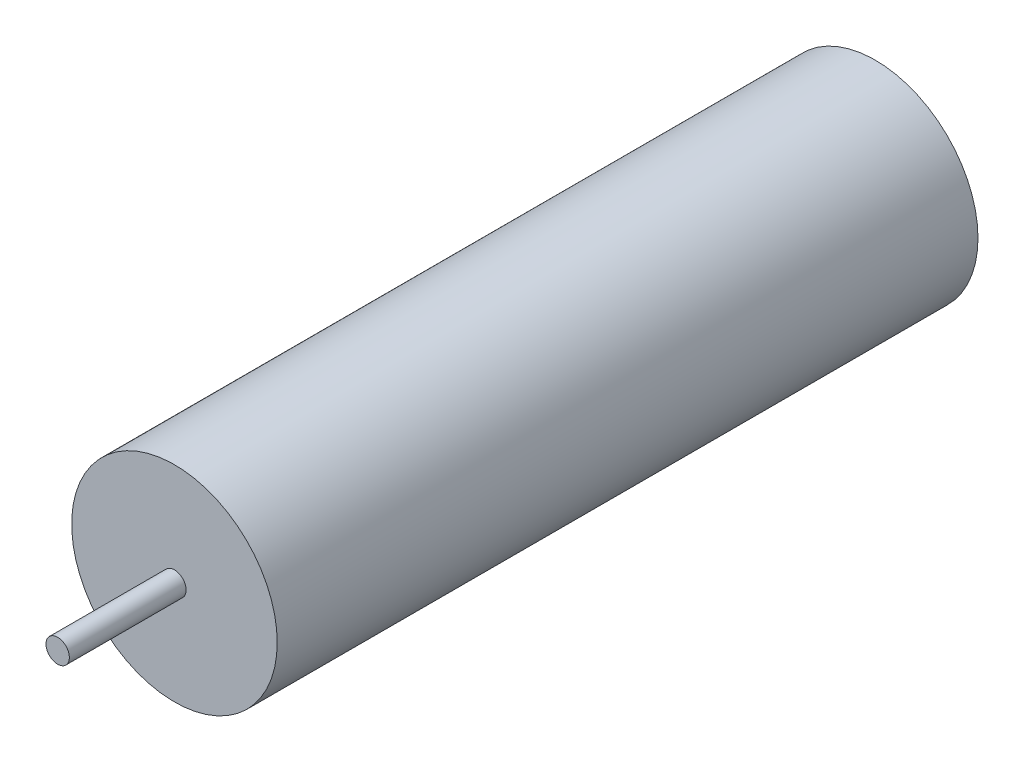
ISO-10303-21;
HEADER;
FILE_DESCRIPTION(('STEP AP214'),'2;1');
FILE_NAME('part.step','',(''),(''),'','','');
FILE_SCHEMA(('AUTOMOTIVE_DESIGN { 1 0 10303 214 1 1 1 1 }'));
ENDSEC;
DATA;
#1=APPLICATION_CONTEXT('core data for automotive mechanical design processes');
#2=APPLICATION_PROTOCOL_DEFINITION('international standard','automotive_design',2000,#1);
#3=PRODUCT_CONTEXT('',#1,'mechanical');
#4=PRODUCT('Part','Part','',(#3));
#5=PRODUCT_RELATED_PRODUCT_CATEGORY('part','',(#4));
#6=PRODUCT_DEFINITION_FORMATION('','',#4);
#7=PRODUCT_DEFINITION_CONTEXT('part definition',#1,'design');
#8=PRODUCT_DEFINITION('design','',#6,#7);
#9=PRODUCT_DEFINITION_SHAPE('','',#8);
#10=(LENGTH_UNIT() NAMED_UNIT(*) SI_UNIT(.MILLI.,.METRE.));
#11=(NAMED_UNIT(*) PLANE_ANGLE_UNIT() SI_UNIT($,.RADIAN.));
#12=(NAMED_UNIT(*) SI_UNIT($,.STERADIAN.) SOLID_ANGLE_UNIT());
#13=UNCERTAINTY_MEASURE_WITH_UNIT(LENGTH_MEASURE(1.E-05),#10,'distance_accuracy_value','');
#14=(GEOMETRIC_REPRESENTATION_CONTEXT(3) GLOBAL_UNCERTAINTY_ASSIGNED_CONTEXT((#13)) GLOBAL_UNIT_ASSIGNED_CONTEXT((#10,
#11,#12)) REPRESENTATION_CONTEXT('',''));
#15=CARTESIAN_POINT('',(0.,0.,0.));
#16=DIRECTION('',(0.,0.,1.));
#17=DIRECTION('',(1.,0.,0.));
#18=AXIS2_PLACEMENT_3D('',#15,#16,#17);
#19=CARTESIAN_POINT('',(4.5102810375397E-13,-25.4000000000004,-76.2));
#20=DIRECTION('',(0.,0.,1.));
#21=DIRECTION('',(1.,0.,0.));
#22=AXIS2_PLACEMENT_3D('',#19,#20,#21);
#23=CYLINDRICAL_SURFACE('',#22,11.176);
#24=CARTESIAN_POINT('',(4.5102810375397E-13,-25.4000000000004,-76.2));
#25=DIRECTION('',(0.,0.,1.));
#26=DIRECTION('',(1.,0.,0.));
#27=AXIS2_PLACEMENT_3D('',#24,#25,#26);
#28=CIRCLE('',#27,11.176);
#29=CARTESIAN_POINT('',(11.1760000000004,-25.4000000000004,-76.2));
#30=VERTEX_POINT('',#29);
#31=EDGE_CURVE('E10',#30,#30,#28,.T.);
#32=ORIENTED_EDGE('',*,*,#31,.T.);
#33=EDGE_LOOP('',(#32));
#34=FACE_BOUND('',#33,.T.);
#35=CARTESIAN_POINT('',(4.5102810375397E-13,-25.4000000000004,0.));
#36=DIRECTION('',(0.,0.,1.));
#37=DIRECTION('',(1.,0.,0.));
#38=AXIS2_PLACEMENT_3D('',#35,#36,#37);
#39=CIRCLE('',#38,11.176);
#40=CARTESIAN_POINT('',(11.1760000000004,-25.4000000000004,0.));
#41=VERTEX_POINT('',#40);
#42=EDGE_CURVE('E38',#41,#41,#39,.T.);
#43=ORIENTED_EDGE('',*,*,#42,.F.);
#44=EDGE_LOOP('',(#43));
#45=FACE_BOUND('',#44,.T.);
#46=ADVANCED_FACE('F35',(#34,#45),#23,.T.);
#47=CARTESIAN_POINT('',(4.5102810375397E-13,-25.4000000000004,-76.2));
#48=DIRECTION('',(0.,0.,1.));
#49=DIRECTION('',(1.,0.,0.));
#50=AXIS2_PLACEMENT_3D('',#47,#48,#49);
#51=PLANE('',#50);
#52=ORIENTED_EDGE('',*,*,#31,.F.);
#53=EDGE_LOOP('',(#52));
#54=FACE_BOUND('',#53,.T.);
#55=ADVANCED_FACE('F64',(#54),#51,.F.);
#56=CARTESIAN_POINT('',(4.5102810375397E-13,-25.4000000000004,0.));
#57=DIRECTION('',(0.,0.,1.));
#58=DIRECTION('',(1.,0.,0.));
#59=AXIS2_PLACEMENT_3D('',#56,#57,#58);
#60=PLANE('',#59);
#61=CARTESIAN_POINT('',(4.5102810375397E-13,-25.4000000000004,0.));
#62=DIRECTION('',(0.,0.,1.));
#63=DIRECTION('',(1.,0.,0.));
#64=AXIS2_PLACEMENT_3D('',#61,#62,#63);
#65=CIRCLE('',#64,1.27000000000026);
#66=CARTESIAN_POINT('',(1.27000000000071,-25.4000000000004,0.));
#67=VERTEX_POINT('',#66);
#68=EDGE_CURVE('E47',#67,#67,#65,.T.);
#69=ORIENTED_EDGE('',*,*,#68,.F.);
#70=EDGE_LOOP('',(#69));
#71=FACE_BOUND('',#70,.T.);
#72=ORIENTED_EDGE('',*,*,#42,.T.);
#73=EDGE_LOOP('',(#72));
#74=FACE_BOUND('',#73,.T.);
#75=ADVANCED_FACE('F58',(#71,#74),#60,.T.);
#76=CARTESIAN_POINT('',(4.5102810375397E-13,-25.4000000000004,12.7));
#77=DIRECTION('',(0.,0.,-1.));
#78=DIRECTION('',(-1.,0.,0.));
#79=AXIS2_PLACEMENT_3D('',#76,#77,#78);
#80=CYLINDRICAL_SURFACE('',#79,1.27000000000026);
#81=CARTESIAN_POINT('',(4.5102810375397E-13,-25.4000000000004,12.7));
#82=DIRECTION('',(0.,0.,1.));
#83=DIRECTION('',(1.,0.,0.));
#84=AXIS2_PLACEMENT_3D('',#81,#82,#83);
#85=CIRCLE('',#84,1.27000000000026);
#86=CARTESIAN_POINT('',(1.27000000000071,-25.4000000000004,12.7));
#87=VERTEX_POINT('',#86);
#88=EDGE_CURVE('E45',#87,#87,#85,.T.);
#89=ORIENTED_EDGE('',*,*,#88,.F.);
#90=EDGE_LOOP('',(#89));
#91=FACE_BOUND('',#90,.T.);
#92=ORIENTED_EDGE('',*,*,#68,.T.);
#93=EDGE_LOOP('',(#92));
#94=FACE_BOUND('',#93,.T.);
#95=ADVANCED_FACE('F55',(#91,#94),#80,.T.);
#96=CARTESIAN_POINT('',(4.5102810375397E-13,-25.4000000000004,12.7));
#97=DIRECTION('',(0.,0.,1.));
#98=DIRECTION('',(1.,0.,0.));
#99=AXIS2_PLACEMENT_3D('',#96,#97,#98);
#100=PLANE('',#99);
#101=ORIENTED_EDGE('',*,*,#88,.T.);
#102=EDGE_LOOP('',(#101));
#103=FACE_BOUND('',#102,.T.);
#104=ADVANCED_FACE('F53',(#103),#100,.T.);
#105=CLOSED_SHELL('',(#46,#55,#75,#95,#104));
#106=MANIFOLD_SOLID_BREP('B2',#105);
#107=ADVANCED_BREP_SHAPE_REPRESENTATION('',(#18,#106),#14);
#108=SHAPE_DEFINITION_REPRESENTATION(#9,#107);
ENDSEC;
END-ISO-10303-21;
